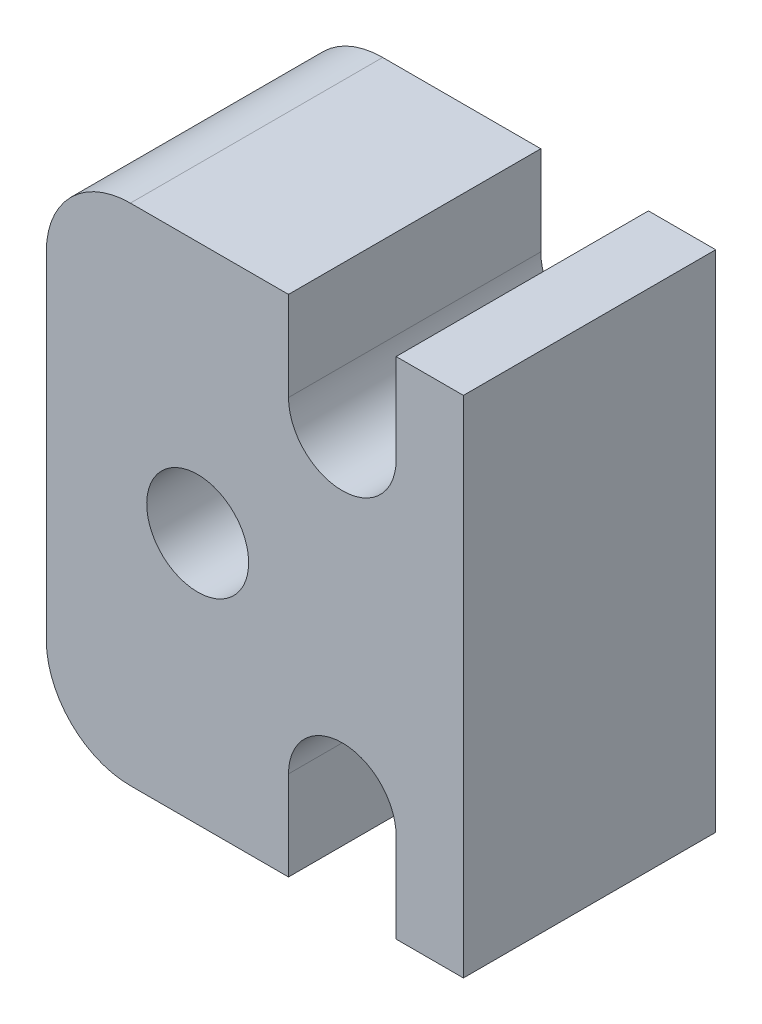
ISO-10303-21;
HEADER;
FILE_DESCRIPTION(('STEP AP214'),'2;1');
FILE_NAME('part.step','',(''),(''),'','','');
FILE_SCHEMA(('AUTOMOTIVE_DESIGN { 1 0 10303 214 1 1 1 1 }'));
ENDSEC;
DATA;
#1=APPLICATION_CONTEXT('core data for automotive mechanical design processes');
#2=APPLICATION_PROTOCOL_DEFINITION('international standard','automotive_design',2000,#1);
#3=PRODUCT_CONTEXT('',#1,'mechanical');
#4=PRODUCT('Part','Part','',(#3));
#5=PRODUCT_RELATED_PRODUCT_CATEGORY('part','',(#4));
#6=PRODUCT_DEFINITION_FORMATION('','',#4);
#7=PRODUCT_DEFINITION_CONTEXT('part definition',#1,'design');
#8=PRODUCT_DEFINITION('design','',#6,#7);
#9=PRODUCT_DEFINITION_SHAPE('','',#8);
#10=(LENGTH_UNIT() NAMED_UNIT(*) SI_UNIT(.MILLI.,.METRE.));
#11=(NAMED_UNIT(*) PLANE_ANGLE_UNIT() SI_UNIT($,.RADIAN.));
#12=(NAMED_UNIT(*) SI_UNIT($,.STERADIAN.) SOLID_ANGLE_UNIT());
#13=UNCERTAINTY_MEASURE_WITH_UNIT(LENGTH_MEASURE(1.E-05),#10,'distance_accuracy_value','');
#14=(GEOMETRIC_REPRESENTATION_CONTEXT(3) GLOBAL_UNCERTAINTY_ASSIGNED_CONTEXT((#13)) GLOBAL_UNIT_ASSIGNED_CONTEXT((#10,
#11,#12)) REPRESENTATION_CONTEXT('',''));
#15=CARTESIAN_POINT('',(0.,0.,0.));
#16=DIRECTION('',(0.,0.,1.));
#17=DIRECTION('',(1.,0.,0.));
#18=AXIS2_PLACEMENT_3D('',#15,#16,#17);
#19=CARTESIAN_POINT('',(-31.5865384615385,-8.11298076923077,7.5));
#20=DIRECTION('',(0.,1.,0.));
#21=DIRECTION('',(0.,0.,1.));
#22=AXIS2_PLACEMENT_3D('',#19,#20,#21);
#23=PLANE('',#22);
#24=DIRECTION('',(1.,0.,0.));
#25=VECTOR('',#24,1.);
#26=CARTESIAN_POINT('',(-31.5865384615385,-8.11298076923077,7.5));
#27=LINE('',#26,#25);
#28=CARTESIAN_POINT('',(-21.1865384615384,-8.11298076923077,7.5));
#29=VERTEX_POINT('',#28);
#30=CARTESIAN_POINT('',(-19.1865384615385,-8.11298076923077,7.5));
#31=VERTEX_POINT('',#30);
#32=EDGE_CURVE('E208',#29,#31,#27,.T.);
#33=ORIENTED_EDGE('',*,*,#32,.F.);
#34=DIRECTION('',(0.,0.,1.));
#35=VECTOR('',#34,1.);
#36=CARTESIAN_POINT('',(-21.1865384615384,-8.11298076923077,-5.3308480277897));
#37=LINE('',#36,#35);
#38=CARTESIAN_POINT('',(-21.1865384615384,-8.11298076923077,0.));
#39=VERTEX_POINT('',#38);
#40=EDGE_CURVE('E164',#39,#29,#37,.T.);
#41=ORIENTED_EDGE('',*,*,#40,.F.);
#42=DIRECTION('',(1.,0.,0.));
#43=VECTOR('',#42,1.);
#44=CARTESIAN_POINT('',(-31.5865384615385,-8.11298076923077,0.));
#45=LINE('',#44,#43);
#46=CARTESIAN_POINT('',(-19.1865384615385,-8.11298076923077,0.));
#47=VERTEX_POINT('',#46);
#48=EDGE_CURVE('E218',#39,#47,#45,.T.);
#49=ORIENTED_EDGE('',*,*,#48,.T.);
#50=DIRECTION('',(0.,0.,-1.));
#51=VECTOR('',#50,1.);
#52=CARTESIAN_POINT('',(-19.1865384615385,-8.11298076923077,7.5));
#53=LINE('',#52,#51);
#54=EDGE_CURVE('E197',#31,#47,#53,.T.);
#55=ORIENTED_EDGE('',*,*,#54,.F.);
#56=EDGE_LOOP('',(#33,#41,#49,#55));
#57=FACE_BOUND('',#56,.T.);
#58=ADVANCED_FACE('F34',(#57),#23,.F.);
#59=CARTESIAN_POINT('',(-31.5865384615385,6.88701923076923,7.5));
#60=DIRECTION('',(0.,-1.,0.));
#61=DIRECTION('',(0.,0.,-1.));
#62=AXIS2_PLACEMENT_3D('',#59,#60,#61);
#63=PLANE('',#62);
#64=DIRECTION('',(-1.,0.,0.));
#65=VECTOR('',#64,1.);
#66=CARTESIAN_POINT('',(-31.5865384615385,6.88701923076923,0.));
#67=LINE('',#66,#65);
#68=CARTESIAN_POINT('',(-19.1865384615385,6.88701923076923,0.));
#69=VERTEX_POINT('',#68);
#70=CARTESIAN_POINT('',(-21.1865384615384,6.88701923076923,0.));
#71=VERTEX_POINT('',#70);
#72=EDGE_CURVE('E209',#69,#71,#67,.T.);
#73=ORIENTED_EDGE('',*,*,#72,.T.);
#74=DIRECTION('',(0.,0.,1.));
#75=VECTOR('',#74,1.);
#76=CARTESIAN_POINT('',(-21.1865384615384,6.88701923076923,7.5));
#77=LINE('',#76,#75);
#78=CARTESIAN_POINT('',(-21.1865384615384,6.88701923076923,7.5));
#79=VERTEX_POINT('',#78);
#80=EDGE_CURVE('E188',#71,#79,#77,.T.);
#81=ORIENTED_EDGE('',*,*,#80,.T.);
#82=DIRECTION('',(-1.,0.,0.));
#83=VECTOR('',#82,1.);
#84=CARTESIAN_POINT('',(-31.5865384615385,6.88701923076923,7.5));
#85=LINE('',#84,#83);
#86=CARTESIAN_POINT('',(-19.1865384615385,6.88701923076923,7.5));
#87=VERTEX_POINT('',#86);
#88=EDGE_CURVE('E212',#87,#79,#85,.T.);
#89=ORIENTED_EDGE('',*,*,#88,.F.);
#90=DIRECTION('',(0.,0.,1.));
#91=VECTOR('',#90,1.);
#92=CARTESIAN_POINT('',(-19.1865384615385,6.88701923076923,7.5));
#93=LINE('',#92,#91);
#94=EDGE_CURVE('E202',#69,#87,#93,.T.);
#95=ORIENTED_EDGE('',*,*,#94,.F.);
#96=EDGE_LOOP('',(#73,#81,#89,#95));
#97=FACE_BOUND('',#96,.T.);
#98=ADVANCED_FACE('F277',(#97),#63,.F.);
#99=CARTESIAN_POINT('',(-29.0865384615385,-8.11298076923077,0.));
#100=VERTEX_POINT('',#99);
#101=CARTESIAN_POINT('',(-24.3865384615384,-8.11298076923077,0.));
#102=VERTEX_POINT('',#101);
#103=EDGE_CURVE('E219',#100,#102,#45,.T.);
#104=ORIENTED_EDGE('',*,*,#103,.T.);
#105=DIRECTION('',(0.,0.,1.));
#106=VECTOR('',#105,1.);
#107=CARTESIAN_POINT('',(-24.3865384615384,-8.11298076923077,-5.3308480277897));
#108=LINE('',#107,#106);
#109=CARTESIAN_POINT('',(-24.3865384615384,-8.11298076923077,7.5));
#110=VERTEX_POINT('',#109);
#111=EDGE_CURVE('E50',#102,#110,#108,.T.);
#112=ORIENTED_EDGE('',*,*,#111,.T.);
#113=CARTESIAN_POINT('',(-29.0865384615385,-8.11298076923077,7.5));
#114=VERTEX_POINT('',#113);
#115=EDGE_CURVE('E157',#114,#110,#27,.T.);
#116=ORIENTED_EDGE('',*,*,#115,.F.);
#117=DIRECTION('',(0.,0.,-1.));
#118=VECTOR('',#117,1.);
#119=CARTESIAN_POINT('',(-29.0865384615385,-8.11298076923077,7.5));
#120=LINE('',#119,#118);
#121=EDGE_CURVE('E215',#114,#100,#120,.T.);
#122=ORIENTED_EDGE('',*,*,#121,.T.);
#123=EDGE_LOOP('',(#104,#112,#116,#122));
#124=FACE_BOUND('',#123,.T.);
#125=ADVANCED_FACE('F245',(#124),#23,.F.);
#126=CARTESIAN_POINT('',(-24.3865384615384,6.88701923076923,7.5));
#127=VERTEX_POINT('',#126);
#128=CARTESIAN_POINT('',(-29.0865384615385,6.88701923076923,7.5));
#129=VERTEX_POINT('',#128);
#130=EDGE_CURVE('E211',#127,#129,#85,.T.);
#131=ORIENTED_EDGE('',*,*,#130,.F.);
#132=DIRECTION('',(0.,0.,-1.));
#133=VECTOR('',#132,1.);
#134=CARTESIAN_POINT('',(-24.3865384615384,6.88701923076923,7.5));
#135=LINE('',#134,#133);
#136=CARTESIAN_POINT('',(-24.3865384615384,6.88701923076923,0.));
#137=VERTEX_POINT('',#136);
#138=EDGE_CURVE('E185',#127,#137,#135,.T.);
#139=ORIENTED_EDGE('',*,*,#138,.T.);
#140=CARTESIAN_POINT('',(-29.0865384615385,6.88701923076923,0.));
#141=VERTEX_POINT('',#140);
#142=EDGE_CURVE('E222',#137,#141,#67,.T.);
#143=ORIENTED_EDGE('',*,*,#142,.T.);
#144=DIRECTION('',(0.,0.,-1.));
#145=VECTOR('',#144,1.);
#146=CARTESIAN_POINT('',(-29.0865384615385,6.88701923076923,7.5));
#147=LINE('',#146,#145);
#148=EDGE_CURVE('E11',#141,#129,#147,.F.);
#149=ORIENTED_EDGE('',*,*,#148,.T.);
#150=EDGE_LOOP('',(#131,#139,#143,#149));
#151=FACE_BOUND('',#150,.T.);
#152=ADVANCED_FACE('F263',(#151),#63,.F.);
#153=CARTESIAN_POINT('',(0.,0.,7.5));
#154=DIRECTION('',(0.,0.,1.));
#155=DIRECTION('',(1.,0.,0.));
#156=AXIS2_PLACEMENT_3D('',#153,#154,#155);
#157=PLANE('',#156);
#158=DIRECTION('',(0.,1.,0.));
#159=VECTOR('',#158,1.);
#160=CARTESIAN_POINT('',(-21.1865384615384,-5.45798076923078,7.5));
#161=LINE('',#160,#159);
#162=CARTESIAN_POINT('',(-21.1865384615384,-5.45798076923078,7.5));
#163=VERTEX_POINT('',#162);
#164=EDGE_CURVE('E142',#29,#163,#161,.T.);
#165=ORIENTED_EDGE('',*,*,#164,.F.);
#166=ORIENTED_EDGE('',*,*,#32,.T.);
#167=DIRECTION('',(0.,-1.,0.));
#168=VECTOR('',#167,1.);
#169=CARTESIAN_POINT('',(-19.1865384615385,6.88701923076923,7.5));
#170=LINE('',#169,#168);
#171=EDGE_CURVE('E194',#87,#31,#170,.T.);
#172=ORIENTED_EDGE('',*,*,#171,.F.);
#173=ORIENTED_EDGE('',*,*,#88,.T.);
#174=DIRECTION('',(0.,1.,0.));
#175=VECTOR('',#174,1.);
#176=CARTESIAN_POINT('',(-21.1865384615384,4.23201923076922,7.5));
#177=LINE('',#176,#175);
#178=CARTESIAN_POINT('',(-21.1865384615384,4.23201923076922,7.5));
#179=VERTEX_POINT('',#178);
#180=EDGE_CURVE('E180',#179,#79,#177,.T.);
#181=ORIENTED_EDGE('',*,*,#180,.F.);
#182=CARTESIAN_POINT('',(-22.7865384615384,4.23201923076922,7.5));
#183=DIRECTION('',(0.,0.,1.));
#184=DIRECTION('',(1.,0.,0.));
#185=AXIS2_PLACEMENT_3D('',#182,#183,#184);
#186=CIRCLE('',#185,1.6);
#187=CARTESIAN_POINT('',(-24.3865384615384,4.23201923076922,7.5));
#188=VERTEX_POINT('',#187);
#189=EDGE_CURVE('E177',#188,#179,#186,.T.);
#190=ORIENTED_EDGE('',*,*,#189,.F.);
#191=DIRECTION('',(0.,-1.,0.));
#192=VECTOR('',#191,1.);
#193=CARTESIAN_POINT('',(-24.3865384615384,4.23201923076922,7.5));
#194=LINE('',#193,#192);
#195=EDGE_CURVE('E168',#127,#188,#194,.T.);
#196=ORIENTED_EDGE('',*,*,#195,.F.);
#197=ORIENTED_EDGE('',*,*,#130,.T.);
#198=CARTESIAN_POINT('',(-29.0865384615385,4.38701923076923,7.5));
#199=DIRECTION('',(0.,0.,1.));
#200=DIRECTION('',(1.,0.,0.));
#201=AXIS2_PLACEMENT_3D('',#198,#199,#200);
#202=CIRCLE('',#201,2.5);
#203=CARTESIAN_POINT('',(-31.5865384615385,4.38701923076923,7.5));
#204=VERTEX_POINT('',#203);
#205=EDGE_CURVE('E237',#129,#204,#202,.T.);
#206=ORIENTED_EDGE('',*,*,#205,.T.);
#207=DIRECTION('',(0.,-1.,0.));
#208=VECTOR('',#207,1.);
#209=CARTESIAN_POINT('',(-31.5865384615385,6.88701923076923,7.5));
#210=LINE('',#209,#208);
#211=CARTESIAN_POINT('',(-31.5865384615385,-5.61298076923077,7.5));
#212=VERTEX_POINT('',#211);
#213=EDGE_CURVE('E205',#204,#212,#210,.T.);
#214=ORIENTED_EDGE('',*,*,#213,.T.);
#215=CARTESIAN_POINT('',(-29.0865384615385,-5.61298076923077,7.5));
#216=DIRECTION('',(0.,0.,1.));
#217=DIRECTION('',(1.,0.,0.));
#218=AXIS2_PLACEMENT_3D('',#215,#216,#217);
#219=CIRCLE('',#218,2.5);
#220=EDGE_CURVE('E43',#212,#114,#219,.T.);
#221=ORIENTED_EDGE('',*,*,#220,.T.);
#222=ORIENTED_EDGE('',*,*,#115,.T.);
#223=DIRECTION('',(0.,-1.,0.));
#224=VECTOR('',#223,1.);
#225=CARTESIAN_POINT('',(-24.3865384615384,-5.45798076923078,7.5));
#226=LINE('',#225,#224);
#227=CARTESIAN_POINT('',(-24.3865384615384,-5.45798076923078,7.5));
#228=VERTEX_POINT('',#227);
#229=EDGE_CURVE('E138',#228,#110,#226,.T.);
#230=ORIENTED_EDGE('',*,*,#229,.F.);
#231=CARTESIAN_POINT('',(-22.7865384615384,-5.45798076923078,7.5));
#232=DIRECTION('',(0.,0.,1.));
#233=DIRECTION('',(1.,0.,0.));
#234=AXIS2_PLACEMENT_3D('',#231,#232,#233);
#235=CIRCLE('',#234,1.6);
#236=EDGE_CURVE('E145',#163,#228,#235,.T.);
#237=ORIENTED_EDGE('',*,*,#236,.F.);
#238=EDGE_LOOP('',(#165,#166,#172,#173,#181,#190,#196,#197,#206,#214,#221,#222,#230,#237));
#239=FACE_BOUND('',#238,.T.);
#240=CARTESIAN_POINT('',(-27.0865384615384,-0.612980769230753,7.5));
#241=DIRECTION('',(0.,0.,1.));
#242=DIRECTION('',(1.,0.,0.));
#243=AXIS2_PLACEMENT_3D('',#240,#241,#242);
#244=CIRCLE('',#243,1.515);
#245=CARTESIAN_POINT('',(-27.0865384615384,-2.12798076923075,7.49999999999999));
#246=VERTEX_POINT('',#245);
#247=EDGE_CURVE('E191',#246,#246,#244,.F.);
#248=ORIENTED_EDGE('',*,*,#247,.T.);
#249=EDGE_LOOP('',(#248));
#250=FACE_BOUND('',#249,.T.);
#251=ADVANCED_FACE('F154',(#239,#250),#157,.T.);
#252=CARTESIAN_POINT('',(0.,0.,0.));
#253=DIRECTION('',(0.,0.,1.));
#254=DIRECTION('',(1.,0.,0.));
#255=AXIS2_PLACEMENT_3D('',#252,#253,#254);
#256=PLANE('',#255);
#257=CARTESIAN_POINT('',(-27.0865384615384,-0.612980769230752,0.));
#258=DIRECTION('',(0.,0.,1.));
#259=DIRECTION('',(1.,0.,0.));
#260=AXIS2_PLACEMENT_3D('',#257,#258,#259);
#261=CIRCLE('',#260,1.515);
#262=CARTESIAN_POINT('',(-27.0865384615384,-2.12798076923075,0.));
#263=VERTEX_POINT('',#262);
#264=EDGE_CURVE('E38',#263,#263,#261,.F.);
#265=ORIENTED_EDGE('',*,*,#264,.F.);
#266=EDGE_LOOP('',(#265));
#267=FACE_BOUND('',#266,.T.);
#268=ORIENTED_EDGE('',*,*,#48,.F.);
#269=DIRECTION('',(0.,-1.,0.));
#270=VECTOR('',#269,1.);
#271=CARTESIAN_POINT('',(-21.1865384615384,-5.45798076923078,0.));
#272=LINE('',#271,#270);
#273=CARTESIAN_POINT('',(-21.1865384615384,-5.45798076923078,0.));
#274=VERTEX_POINT('',#273);
#275=EDGE_CURVE('E163',#274,#39,#272,.T.);
#276=ORIENTED_EDGE('',*,*,#275,.F.);
#277=CARTESIAN_POINT('',(-22.7865384615384,-5.45798076923078,0.));
#278=DIRECTION('',(0.,0.,1.));
#279=DIRECTION('',(1.,0.,0.));
#280=AXIS2_PLACEMENT_3D('',#277,#278,#279);
#281=CIRCLE('',#280,1.6);
#282=CARTESIAN_POINT('',(-24.3865384615384,-5.45798076923078,0.));
#283=VERTEX_POINT('',#282);
#284=EDGE_CURVE('E169',#283,#274,#281,.F.);
#285=ORIENTED_EDGE('',*,*,#284,.F.);
#286=DIRECTION('',(0.,1.,0.));
#287=VECTOR('',#286,1.);
#288=CARTESIAN_POINT('',(-24.3865384615384,-5.45798076923078,0.));
#289=LINE('',#288,#287);
#290=EDGE_CURVE('E139',#102,#283,#289,.T.);
#291=ORIENTED_EDGE('',*,*,#290,.F.);
#292=ORIENTED_EDGE('',*,*,#103,.F.);
#293=CARTESIAN_POINT('',(-29.0865384615385,-5.61298076923077,0.));
#294=DIRECTION('',(0.,0.,1.));
#295=DIRECTION('',(1.,0.,0.));
#296=AXIS2_PLACEMENT_3D('',#293,#294,#295);
#297=CIRCLE('',#296,2.5);
#298=CARTESIAN_POINT('',(-31.5865384615385,-5.61298076923077,0.));
#299=VERTEX_POINT('',#298);
#300=EDGE_CURVE('E230',#100,#299,#297,.F.);
#301=ORIENTED_EDGE('',*,*,#300,.T.);
#302=DIRECTION('',(0.,-1.,0.));
#303=VECTOR('',#302,1.);
#304=CARTESIAN_POINT('',(-31.5865384615385,6.88701923076923,0.));
#305=LINE('',#304,#303);
#306=CARTESIAN_POINT('',(-31.5865384615385,4.38701923076923,0.));
#307=VERTEX_POINT('',#306);
#308=EDGE_CURVE('E204',#307,#299,#305,.T.);
#309=ORIENTED_EDGE('',*,*,#308,.F.);
#310=CARTESIAN_POINT('',(-29.0865384615385,4.38701923076923,0.));
#311=DIRECTION('',(0.,0.,1.));
#312=DIRECTION('',(1.,0.,0.));
#313=AXIS2_PLACEMENT_3D('',#310,#311,#312);
#314=CIRCLE('',#313,2.5);
#315=EDGE_CURVE('E227',#307,#141,#314,.F.);
#316=ORIENTED_EDGE('',*,*,#315,.T.);
#317=ORIENTED_EDGE('',*,*,#142,.F.);
#318=DIRECTION('',(0.,1.,0.));
#319=VECTOR('',#318,1.);
#320=CARTESIAN_POINT('',(-24.3865384615384,4.23201923076922,0.));
#321=LINE('',#320,#319);
#322=CARTESIAN_POINT('',(-24.3865384615384,4.23201923076922,0.));
#323=VERTEX_POINT('',#322);
#324=EDGE_CURVE('E175',#323,#137,#321,.T.);
#325=ORIENTED_EDGE('',*,*,#324,.F.);
#326=CARTESIAN_POINT('',(-22.7865384615384,4.23201923076922,0.));
#327=DIRECTION('',(0.,0.,1.));
#328=DIRECTION('',(1.,0.,0.));
#329=AXIS2_PLACEMENT_3D('',#326,#327,#328);
#330=CIRCLE('',#329,1.6);
#331=CARTESIAN_POINT('',(-21.1865384615384,4.23201923076922,0.));
#332=VERTEX_POINT('',#331);
#333=EDGE_CURVE('E170',#332,#323,#330,.F.);
#334=ORIENTED_EDGE('',*,*,#333,.F.);
#335=DIRECTION('',(0.,-1.,0.));
#336=VECTOR('',#335,1.);
#337=CARTESIAN_POINT('',(-21.1865384615384,4.23201923076922,0.));
#338=LINE('',#337,#336);
#339=EDGE_CURVE('E172',#71,#332,#338,.T.);
#340=ORIENTED_EDGE('',*,*,#339,.F.);
#341=ORIENTED_EDGE('',*,*,#72,.F.);
#342=DIRECTION('',(0.,1.,0.));
#343=VECTOR('',#342,1.);
#344=CARTESIAN_POINT('',(-19.1865384615385,6.88701923076923,0.));
#345=LINE('',#344,#343);
#346=EDGE_CURVE('E200',#47,#69,#345,.T.);
#347=ORIENTED_EDGE('',*,*,#346,.F.);
#348=EDGE_LOOP('',(#268,#276,#285,#291,#292,#301,#309,#316,#317,#325,#334,#340,#341,#347));
#349=FACE_BOUND('',#348,.T.);
#350=ADVANCED_FACE('F251',(#267,#349),#256,.F.);
#351=CARTESIAN_POINT('',(-31.5865384615385,6.88701923076923,7.5));
#352=DIRECTION('',(1.,0.,0.));
#353=DIRECTION('',(0.,0.,-1.));
#354=AXIS2_PLACEMENT_3D('',#351,#352,#353);
#355=PLANE('',#354);
#356=ORIENTED_EDGE('',*,*,#308,.T.);
#357=DIRECTION('',(0.,0.,-1.));
#358=VECTOR('',#357,1.);
#359=CARTESIAN_POINT('',(-31.5865384615385,-5.61298076923077,7.5));
#360=LINE('',#359,#358);
#361=EDGE_CURVE('E235',#299,#212,#360,.F.);
#362=ORIENTED_EDGE('',*,*,#361,.T.);
#363=ORIENTED_EDGE('',*,*,#213,.F.);
#364=DIRECTION('',(0.,0.,-1.));
#365=VECTOR('',#364,1.);
#366=CARTESIAN_POINT('',(-31.5865384615385,4.38701923076923,7.5));
#367=LINE('',#366,#365);
#368=EDGE_CURVE('E232',#204,#307,#367,.T.);
#369=ORIENTED_EDGE('',*,*,#368,.T.);
#370=EDGE_LOOP('',(#356,#362,#363,#369));
#371=FACE_BOUND('',#370,.T.);
#372=ADVANCED_FACE('F253',(#371),#355,.F.);
#373=CARTESIAN_POINT('',(-29.0865384615385,-5.61298076923077,7.5));
#374=DIRECTION('',(0.,0.,-1.));
#375=DIRECTION('',(-1.,0.,0.));
#376=AXIS2_PLACEMENT_3D('',#373,#374,#375);
#377=CYLINDRICAL_SURFACE('',#376,2.5);
#378=ORIENTED_EDGE('',*,*,#220,.F.);
#379=ORIENTED_EDGE('',*,*,#361,.F.);
#380=ORIENTED_EDGE('',*,*,#300,.F.);
#381=ORIENTED_EDGE('',*,*,#121,.F.);
#382=EDGE_LOOP('',(#378,#379,#380,#381));
#383=FACE_BOUND('',#382,.T.);
#384=ADVANCED_FACE('F247',(#383),#377,.T.);
#385=CARTESIAN_POINT('',(-29.0865384615385,4.38701923076923,7.5));
#386=DIRECTION('',(0.,0.,-1.));
#387=DIRECTION('',(-1.,0.,0.));
#388=AXIS2_PLACEMENT_3D('',#385,#386,#387);
#389=CYLINDRICAL_SURFACE('',#388,2.5);
#390=ORIENTED_EDGE('',*,*,#205,.F.);
#391=ORIENTED_EDGE('',*,*,#148,.F.);
#392=ORIENTED_EDGE('',*,*,#315,.F.);
#393=ORIENTED_EDGE('',*,*,#368,.F.);
#394=EDGE_LOOP('',(#390,#391,#392,#393));
#395=FACE_BOUND('',#394,.T.);
#396=ADVANCED_FACE('F36',(#395),#389,.T.);
#397=CARTESIAN_POINT('',(-19.1865384615385,0.,0.));
#398=DIRECTION('',(1.,0.,0.));
#399=DIRECTION('',(0.,0.,-1.));
#400=AXIS2_PLACEMENT_3D('',#397,#398,#399);
#401=PLANE('',#400);
#402=ORIENTED_EDGE('',*,*,#171,.T.);
#403=ORIENTED_EDGE('',*,*,#54,.T.);
#404=ORIENTED_EDGE('',*,*,#346,.T.);
#405=ORIENTED_EDGE('',*,*,#94,.T.);
#406=EDGE_LOOP('',(#402,#403,#404,#405));
#407=FACE_BOUND('',#406,.T.);
#408=ADVANCED_FACE('F281',(#407),#401,.T.);
#409=CARTESIAN_POINT('',(-27.0865384615384,-0.612980769230759,56.6574765312196));
#410=DIRECTION('',(0.,0.,-1.));
#411=DIRECTION('',(0.,-1.,0.));
#412=AXIS2_PLACEMENT_3D('',#409,#410,#411);
#413=CYLINDRICAL_SURFACE('',#412,1.515);
#414=CARTESIAN_POINT('',(-27.0865384615384,-2.12798076923075,7.49999999999999));
#415=CARTESIAN_POINT('',(-27.0865384615384,-2.12798076923075,7.42187499999999));
#416=CARTESIAN_POINT('',(-27.0865384615384,-2.12798076923075,7.34374999999999));
#417=CARTESIAN_POINT('',(-27.0865384615384,-2.12798076923075,7.18749999999999));
#418=CARTESIAN_POINT('',(-27.0865384615384,-2.12798076923075,7.10937499999999));
#419=CARTESIAN_POINT('',(-27.0865384615384,-2.12798076923075,6.95312499999999));
#420=CARTESIAN_POINT('',(-27.0865384615384,-2.12798076923075,6.87499999999999));
#421=CARTESIAN_POINT('',(-27.0865384615384,-2.12798076923075,6.71874999999999));
#422=CARTESIAN_POINT('',(-27.0865384615384,-2.12798076923075,6.64062499999999));
#423=CARTESIAN_POINT('',(-27.0865384615384,-2.12798076923075,6.48437499999999));
#424=CARTESIAN_POINT('',(-27.0865384615384,-2.12798076923075,6.40625));
#425=CARTESIAN_POINT('',(-27.0865384615384,-2.12798076923075,6.25));
#426=CARTESIAN_POINT('',(-27.0865384615384,-2.12798076923075,6.171875));
#427=CARTESIAN_POINT('',(-27.0865384615384,-2.12798076923075,6.01562499999999));
#428=CARTESIAN_POINT('',(-27.0865384615384,-2.12798076923075,5.93749999999999));
#429=CARTESIAN_POINT('',(-27.0865384615384,-2.12798076923075,5.78124999999999));
#430=CARTESIAN_POINT('',(-27.0865384615384,-2.12798076923075,5.70312499999999));
#431=CARTESIAN_POINT('',(-27.0865384615384,-2.12798076923075,5.54687499999999));
#432=CARTESIAN_POINT('',(-27.0865384615384,-2.12798076923075,5.46874999999999));
#433=CARTESIAN_POINT('',(-27.0865384615384,-2.12798076923075,5.3125));
#434=CARTESIAN_POINT('',(-27.0865384615384,-2.12798076923075,5.23437499999999));
#435=CARTESIAN_POINT('',(-27.0865384615384,-2.12798076923075,5.07812499999999));
#436=CARTESIAN_POINT('',(-27.0865384615384,-2.12798076923075,4.99999999999999));
#437=CARTESIAN_POINT('',(-27.0865384615384,-2.12798076923075,4.84374999999999));
#438=CARTESIAN_POINT('',(-27.0865384615384,-2.12798076923075,4.765625));
#439=CARTESIAN_POINT('',(-27.0865384615384,-2.12798076923075,4.609375));
#440=CARTESIAN_POINT('',(-27.0865384615384,-2.12798076923075,4.53125));
#441=CARTESIAN_POINT('',(-27.0865384615384,-2.12798076923075,4.37499999999999));
#442=CARTESIAN_POINT('',(-27.0865384615384,-2.12798076923075,4.29687499999999));
#443=CARTESIAN_POINT('',(-27.0865384615384,-2.12798076923075,4.14062499999999));
#444=CARTESIAN_POINT('',(-27.0865384615384,-2.12798076923075,4.0625));
#445=CARTESIAN_POINT('',(-27.0865384615384,-2.12798076923075,3.90625));
#446=CARTESIAN_POINT('',(-27.0865384615384,-2.12798076923075,3.828125));
#447=CARTESIAN_POINT('',(-27.0865384615384,-2.12798076923075,3.671875));
#448=CARTESIAN_POINT('',(-27.0865384615384,-2.12798076923075,3.59375));
#449=CARTESIAN_POINT('',(-27.0865384615384,-2.12798076923075,3.4375));
#450=CARTESIAN_POINT('',(-27.0865384615384,-2.12798076923075,3.359375));
#451=CARTESIAN_POINT('',(-27.0865384615384,-2.12798076923075,3.203125));
#452=CARTESIAN_POINT('',(-27.0865384615384,-2.12798076923075,3.125));
#453=CARTESIAN_POINT('',(-27.0865384615384,-2.12798076923075,2.96875));
#454=CARTESIAN_POINT('',(-27.0865384615384,-2.12798076923075,2.890625));
#455=CARTESIAN_POINT('',(-27.0865384615384,-2.12798076923075,2.734375));
#456=CARTESIAN_POINT('',(-27.0865384615384,-2.12798076923075,2.65625));
#457=CARTESIAN_POINT('',(-27.0865384615384,-2.12798076923075,2.5));
#458=CARTESIAN_POINT('',(-27.0865384615384,-2.12798076923075,2.421875));
#459=CARTESIAN_POINT('',(-27.0865384615384,-2.12798076923075,2.265625));
#460=CARTESIAN_POINT('',(-27.0865384615384,-2.12798076923075,2.1875));
#461=CARTESIAN_POINT('',(-27.0865384615384,-2.12798076923075,2.03125));
#462=CARTESIAN_POINT('',(-27.0865384615384,-2.12798076923075,1.953125));
#463=CARTESIAN_POINT('',(-27.0865384615384,-2.12798076923075,1.796875));
#464=CARTESIAN_POINT('',(-27.0865384615384,-2.12798076923075,1.71875));
#465=CARTESIAN_POINT('',(-27.0865384615384,-2.12798076923075,1.5625));
#466=CARTESIAN_POINT('',(-27.0865384615384,-2.12798076923075,1.484375));
#467=CARTESIAN_POINT('',(-27.0865384615384,-2.12798076923075,1.328125));
#468=CARTESIAN_POINT('',(-27.0865384615384,-2.12798076923075,1.25));
#469=CARTESIAN_POINT('',(-27.0865384615384,-2.12798076923075,1.09375));
#470=CARTESIAN_POINT('',(-27.0865384615384,-2.12798076923075,1.015625));
#471=CARTESIAN_POINT('',(-27.0865384615384,-2.12798076923075,0.859375));
#472=CARTESIAN_POINT('',(-27.0865384615384,-2.12798076923075,0.78125));
#473=CARTESIAN_POINT('',(-27.0865384615384,-2.12798076923075,0.624999999999998));
#474=CARTESIAN_POINT('',(-27.0865384615384,-2.12798076923075,0.546874999999998));
#475=CARTESIAN_POINT('',(-27.0865384615384,-2.12798076923075,0.390624999999999));
#476=CARTESIAN_POINT('',(-27.0865384615384,-2.12798076923075,0.3125));
#477=CARTESIAN_POINT('',(-27.0865384615384,-2.12798076923075,0.156250000000001));
#478=CARTESIAN_POINT('',(-27.0865384615384,-2.12798076923075,0.0781250000000007));
#479=CARTESIAN_POINT('',(-27.0865384615384,-2.12798076923075,0.));
#480=B_SPLINE_CURVE_WITH_KNOTS('',3,(#414,#415,#416,#417,#418,#419,#420,#421,#422,#423,#424,
#425,#426,#427,#428,#429,#430,#431,#432,#433,#434,#435,#436,#437,#438,#439,#440,#441,#442,#443,
#444,#445,#446,#447,#448,#449,#450,#451,#452,#453,#454,#455,#456,#457,#458,#459,#460,#461,#462,
#463,#464,#465,#466,#467,#468,#469,#470,#471,#472,#473,#474,#475,#476,#477,#478,#479),
.UNSPECIFIED.,.F.,.F.,(4,2,2,2,2,2,2,2,2,2,2,2,2,2,2,2,2,2,2,2,2,2,2,2,2,2,2,2,2,2,2,2,4),(0.,
0.234375000000002,0.468749999999997,0.703124999999999,0.937500000000001,1.171875,1.40625,
1.640625,1.875,2.109375,2.34375,2.578125,2.8125,3.046875,3.28125,3.51562499999999,3.75,3.984375,
4.21874999999999,4.453125,4.6875,4.92187499999999,5.15624999999999,5.390625,5.62499999999999,
5.85937499999999,6.09374999999999,6.32812499999999,6.56249999999999,6.79687499999999,7.03125,
7.26562499999999,7.49999999999999),.UNSPECIFIED.);
#481=EDGE_CURVE('BSEAM319',#246,#263,#480,.T.);
#482=ORIENTED_EDGE('',*,*,#247,.F.);
#483=ORIENTED_EDGE('',*,*,#264,.T.);
#484=ORIENTED_EDGE('',*,*,#481,.T.);
#485=ORIENTED_EDGE('',*,*,#481,.F.);
#486=EDGE_LOOP('',(#482,#484,#483,#485));
#487=FACE_BOUND('',#486,.T.);
#488=ADVANCED_FACE('F319',(#487),#413,.F.);
#489=CARTESIAN_POINT('',(-21.1865384615384,4.23201923076922,-5.3308480277897));
#490=DIRECTION('',(1.,0.,0.));
#491=DIRECTION('',(0.,0.,-1.));
#492=AXIS2_PLACEMENT_3D('',#489,#490,#491);
#493=PLANE('',#492);
#494=ORIENTED_EDGE('',*,*,#339,.T.);
#495=DIRECTION('',(0.,0.,1.));
#496=VECTOR('',#495,1.);
#497=CARTESIAN_POINT('',(-21.1865384615384,4.23201923076922,-5.3308480277897));
#498=LINE('',#497,#496);
#499=EDGE_CURVE('E173',#332,#179,#498,.T.);
#500=ORIENTED_EDGE('',*,*,#499,.T.);
#501=ORIENTED_EDGE('',*,*,#180,.T.);
#502=ORIENTED_EDGE('',*,*,#80,.F.);
#503=EDGE_LOOP('',(#494,#500,#501,#502));
#504=FACE_BOUND('',#503,.T.);
#505=ADVANCED_FACE('F322',(#504),#493,.F.);
#506=CARTESIAN_POINT('',(-24.3865384615384,4.23201923076922,-5.3308480277897));
#507=DIRECTION('',(-1.,0.,0.));
#508=DIRECTION('',(0.,0.,1.));
#509=AXIS2_PLACEMENT_3D('',#506,#507,#508);
#510=PLANE('',#509);
#511=ORIENTED_EDGE('',*,*,#195,.T.);
#512=DIRECTION('',(0.,0.,1.));
#513=VECTOR('',#512,1.);
#514=CARTESIAN_POINT('',(-24.3865384615384,4.23201923076922,-5.3308480277897));
#515=LINE('',#514,#513);
#516=EDGE_CURVE('E58',#323,#188,#515,.T.);
#517=ORIENTED_EDGE('',*,*,#516,.F.);
#518=ORIENTED_EDGE('',*,*,#324,.T.);
#519=ORIENTED_EDGE('',*,*,#138,.F.);
#520=EDGE_LOOP('',(#511,#517,#518,#519));
#521=FACE_BOUND('',#520,.T.);
#522=ADVANCED_FACE('F265',(#521),#510,.F.);
#523=CARTESIAN_POINT('',(-22.7865384615384,4.23201923076922,-5.3308480277897));
#524=DIRECTION('',(0.,0.,1.));
#525=DIRECTION('',(1.,0.,0.));
#526=AXIS2_PLACEMENT_3D('',#523,#524,#525);
#527=CYLINDRICAL_SURFACE('',#526,1.6);
#528=ORIENTED_EDGE('',*,*,#333,.T.);
#529=ORIENTED_EDGE('',*,*,#516,.T.);
#530=ORIENTED_EDGE('',*,*,#189,.T.);
#531=ORIENTED_EDGE('',*,*,#499,.F.);
#532=EDGE_LOOP('',(#528,#529,#530,#531));
#533=FACE_BOUND('',#532,.T.);
#534=ADVANCED_FACE('F270',(#533),#527,.F.);
#535=CARTESIAN_POINT('',(-22.7865384615384,-5.45798076923078,-5.3308480277897));
#536=DIRECTION('',(0.,0.,1.));
#537=DIRECTION('',(1.,0.,0.));
#538=AXIS2_PLACEMENT_3D('',#535,#536,#537);
#539=CYLINDRICAL_SURFACE('',#538,1.6);
#540=ORIENTED_EDGE('',*,*,#284,.T.);
#541=DIRECTION('',(0.,0.,1.));
#542=VECTOR('',#541,1.);
#543=CARTESIAN_POINT('',(-21.1865384615384,-5.45798076923078,-5.3308480277897));
#544=LINE('',#543,#542);
#545=EDGE_CURVE('E148',#274,#163,#544,.T.);
#546=ORIENTED_EDGE('',*,*,#545,.T.);
#547=ORIENTED_EDGE('',*,*,#236,.T.);
#548=DIRECTION('',(0.,0.,1.));
#549=VECTOR('',#548,1.);
#550=CARTESIAN_POINT('',(-24.3865384615384,-5.45798076923078,-5.3308480277897));
#551=LINE('',#550,#549);
#552=EDGE_CURVE('E134',#283,#228,#551,.T.);
#553=ORIENTED_EDGE('',*,*,#552,.F.);
#554=EDGE_LOOP('',(#540,#546,#547,#553));
#555=FACE_BOUND('',#554,.T.);
#556=ADVANCED_FACE('F146',(#555),#539,.F.);
#557=CARTESIAN_POINT('',(-21.1865384615384,-5.45798076923078,-5.3308480277897));
#558=DIRECTION('',(1.,0.,0.));
#559=DIRECTION('',(0.,0.,-1.));
#560=AXIS2_PLACEMENT_3D('',#557,#558,#559);
#561=PLANE('',#560);
#562=ORIENTED_EDGE('',*,*,#275,.T.);
#563=ORIENTED_EDGE('',*,*,#40,.T.);
#564=ORIENTED_EDGE('',*,*,#164,.T.);
#565=ORIENTED_EDGE('',*,*,#545,.F.);
#566=EDGE_LOOP('',(#562,#563,#564,#565));
#567=FACE_BOUND('',#566,.T.);
#568=ADVANCED_FACE('F289',(#567),#561,.F.);
#569=CARTESIAN_POINT('',(-24.3865384615384,-5.45798076923078,-5.3308480277897));
#570=DIRECTION('',(-1.,0.,0.));
#571=DIRECTION('',(0.,-1.,0.));
#572=AXIS2_PLACEMENT_3D('',#569,#570,#571);
#573=PLANE('',#572);
#574=ORIENTED_EDGE('',*,*,#290,.T.);
#575=ORIENTED_EDGE('',*,*,#552,.T.);
#576=ORIENTED_EDGE('',*,*,#229,.T.);
#577=ORIENTED_EDGE('',*,*,#111,.F.);
#578=EDGE_LOOP('',(#574,#575,#576,#577));
#579=FACE_BOUND('',#578,.T.);
#580=ADVANCED_FACE('F136',(#579),#573,.F.);
#581=CLOSED_SHELL('',(#58,#98,#125,#152,#251,#350,#372,#384,#396,#408,#488,#505,#522,#534,#556,
#568,#580));
#582=MANIFOLD_SOLID_BREP('B2',#581);
#583=ADVANCED_BREP_SHAPE_REPRESENTATION('',(#18,#582),#14);
#584=SHAPE_DEFINITION_REPRESENTATION(#9,#583);
ENDSEC;
END-ISO-10303-21;
